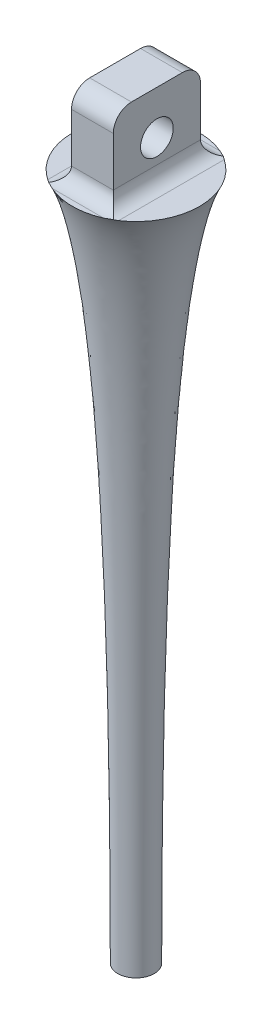
ISO-10303-21;
HEADER;
FILE_DESCRIPTION(('STEP AP214'),'2;1');
FILE_NAME('part.step','',(''),(''),'','','');
FILE_SCHEMA(('AUTOMOTIVE_DESIGN { 1 0 10303 214 1 1 1 1 }'));
ENDSEC;
DATA;
#1=APPLICATION_CONTEXT('core data for automotive mechanical design processes');
#2=APPLICATION_PROTOCOL_DEFINITION('international standard','automotive_design',2000,#1);
#3=PRODUCT_CONTEXT('',#1,'mechanical');
#4=PRODUCT('Part','Part','',(#3));
#5=PRODUCT_RELATED_PRODUCT_CATEGORY('part','',(#4));
#6=PRODUCT_DEFINITION_FORMATION('','',#4);
#7=PRODUCT_DEFINITION_CONTEXT('part definition',#1,'design');
#8=PRODUCT_DEFINITION('design','',#6,#7);
#9=PRODUCT_DEFINITION_SHAPE('','',#8);
#10=(LENGTH_UNIT() NAMED_UNIT(*) SI_UNIT(.MILLI.,.METRE.));
#11=(NAMED_UNIT(*) PLANE_ANGLE_UNIT() SI_UNIT($,.RADIAN.));
#12=(NAMED_UNIT(*) SI_UNIT($,.STERADIAN.) SOLID_ANGLE_UNIT());
#13=UNCERTAINTY_MEASURE_WITH_UNIT(LENGTH_MEASURE(1.E-05),#10,'distance_accuracy_value','');
#14=(GEOMETRIC_REPRESENTATION_CONTEXT(3) GLOBAL_UNCERTAINTY_ASSIGNED_CONTEXT((#13)) GLOBAL_UNIT_ASSIGNED_CONTEXT((#10,
#11,#12)) REPRESENTATION_CONTEXT('',''));
#15=CARTESIAN_POINT('',(0.,0.,0.));
#16=DIRECTION('',(0.,0.,1.));
#17=DIRECTION('',(1.,0.,0.));
#18=AXIS2_PLACEMENT_3D('',#15,#16,#17);
#19=CARTESIAN_POINT('',(0.,0.,0.));
#20=DIRECTION('',(0.,-1.,0.));
#21=DIRECTION('',(1.,0.,0.));
#22=AXIS2_PLACEMENT_3D('',#19,#20,#21);
#23=PLANE('',#22);
#24=CARTESIAN_POINT('',(0.,0.,0.));
#25=DIRECTION('',(0.,1.,0.));
#26=DIRECTION('',(-1.,0.,0.));
#27=AXIS2_PLACEMENT_3D('',#24,#25,#26);
#28=CIRCLE('',#27,3.5);
#29=CARTESIAN_POINT('',(-1.95,0.,-2.90645832586672));
#30=VERTEX_POINT('',#29);
#31=CARTESIAN_POINT('',(-1.95,0.,2.90645832586672));
#32=VERTEX_POINT('',#31);
#33=EDGE_CURVE('E167',#30,#32,#28,.T.);
#34=ORIENTED_EDGE('',*,*,#33,.T.);
#35=DIRECTION('',(0.,0.,1.));
#36=VECTOR('',#35,1.);
#37=CARTESIAN_POINT('',(-1.95,0.,-2.4));
#38=LINE('',#37,#36);
#39=EDGE_CURVE('E173',#32,#30,#38,.F.);
#40=ORIENTED_EDGE('',*,*,#39,.T.);
#41=EDGE_LOOP('',(#34,#40));
#42=FACE_BOUND('',#41,.T.);
#43=ADVANCED_FACE('F32',(#42),#23,.F.);
#44=CARTESIAN_POINT('',(1.41774468787578,0.,-3.2));
#45=VERTEX_POINT('',#44);
#46=CARTESIAN_POINT('',(-1.41774468787578,0.,-3.2));
#47=VERTEX_POINT('',#46);
#48=EDGE_CURVE('E264',#45,#47,#28,.T.);
#49=ORIENTED_EDGE('',*,*,#48,.T.);
#50=DIRECTION('',(-1.,0.,0.));
#51=VECTOR('',#50,1.);
#52=CARTESIAN_POINT('',(1.15,0.,-3.2));
#53=LINE('',#52,#51);
#54=EDGE_CURVE('E171',#47,#45,#53,.F.);
#55=ORIENTED_EDGE('',*,*,#54,.T.);
#56=EDGE_LOOP('',(#49,#55));
#57=FACE_BOUND('',#56,.T.);
#58=ADVANCED_FACE('F243',(#57),#23,.F.);
#59=CARTESIAN_POINT('',(-1.41774468787578,0.,3.2));
#60=VERTEX_POINT('',#59);
#61=CARTESIAN_POINT('',(1.41774468787578,0.,3.2));
#62=VERTEX_POINT('',#61);
#63=EDGE_CURVE('E160',#60,#62,#28,.T.);
#64=ORIENTED_EDGE('',*,*,#63,.T.);
#65=DIRECTION('',(1.,0.,0.));
#66=VECTOR('',#65,1.);
#67=CARTESIAN_POINT('',(-1.15,0.,3.2));
#68=LINE('',#67,#66);
#69=EDGE_CURVE('E162',#62,#60,#68,.F.);
#70=ORIENTED_EDGE('',*,*,#69,.T.);
#71=EDGE_LOOP('',(#64,#70));
#72=FACE_BOUND('',#71,.T.);
#73=ADVANCED_FACE('F248',(#72),#23,.F.);
#74=CARTESIAN_POINT('',(1.95,0.,2.90645832586672));
#75=VERTEX_POINT('',#74);
#76=CARTESIAN_POINT('',(1.95,0.,-2.90645832586672));
#77=VERTEX_POINT('',#76);
#78=EDGE_CURVE('E165',#75,#77,#28,.T.);
#79=ORIENTED_EDGE('',*,*,#78,.T.);
#80=DIRECTION('',(0.,0.,-1.));
#81=VECTOR('',#80,1.);
#82=CARTESIAN_POINT('',(1.95,0.,2.4));
#83=LINE('',#82,#81);
#84=EDGE_CURVE('E159',#77,#75,#83,.F.);
#85=ORIENTED_EDGE('',*,*,#84,.T.);
#86=EDGE_LOOP('',(#79,#85));
#87=FACE_BOUND('',#86,.T.);
#88=ADVANCED_FACE('F199',(#87),#23,.F.);
#89=CARTESIAN_POINT('',(1.,-37.8205680679207,0.));
#90=CARTESIAN_POINT('',(0.999999999999997,-11.1835944695086,0.));
#91=CARTESIAN_POINT('',(2.18653421701543,-2.52553796459548,0.));
#92=CARTESIAN_POINT('',(3.5,0.,0.));
#93=CARTESIAN_POINT('',(3.51313465782985,0.0252553796459548,0.));
#94=CARTESIAN_POINT('',(3.52626931565969,0.0505107592919096,0.));
#95=CARTESIAN_POINT('',(3.53940397348954,0.0757661389378643,0.));
#96=B_SPLINE_CURVE_WITH_KNOTS('',3,(#89,#90,#91,#92,#93,#94,#95),.UNSPECIFIED.,.F.,.F.,(4,3,4),
(0.,1.,1.01),.UNSPECIFIED.);
#97=CARTESIAN_POINT('',(0.,0.,0.));
#98=DIRECTION('',(0.,1.,0.));
#99=AXIS1_PLACEMENT('',#97,#98);
#100=SURFACE_OF_REVOLUTION('',#96,#99);
#101=ORIENTED_EDGE('',*,*,#63,.F.);
#102=CARTESIAN_POINT('',(-1.41774468787578,0.,3.2));
#103=CARTESIAN_POINT('',(-1.43804222254705,-3.94687160879733E-08,3.19100735660219));
#104=CARTESIAN_POINT('',(-1.45828628533577,0.000151630970978614,3.18189346900746));
#105=CARTESIAN_POINT('',(-1.49865012133321,0.000782335440212966,3.16344557331929));
#106=CARTESIAN_POINT('',(-1.51876997722664,0.00126112087444249,3.15411173757547));
#107=CARTESIAN_POINT('',(-1.55889077175201,0.00256966151873528,3.13523642657953));
#108=CARTESIAN_POINT('',(-1.57889175513437,0.00339927488720019,3.12569503671984));
#109=CARTESIAN_POINT('',(-1.61878110432213,0.00543334867689876,3.10641696434359));
#110=CARTESIAN_POINT('',(-1.63866946644596,0.00663782128103746,3.09668027548944));
#111=CARTESIAN_POINT('',(-1.67833737442683,0.00944587178265502,3.07702537496586));
#112=CARTESIAN_POINT('',(-1.69811687710415,0.0110495978125892,3.06710709719089));
#113=CARTESIAN_POINT('',(-1.73757190159674,0.0146809805103041,3.04710314087347));
#114=CARTESIAN_POINT('',(-1.75724732752526,0.0167089754303448,3.03701733470986));
#115=CARTESIAN_POINT('',(-1.77686102609484,0.0189603750672665,3.02686102609484));
#116=B_SPLINE_CURVE_WITH_KNOTS('',3,(#102,#103,#104,#105,#106,#107,#108,#109,#110,#111,#112,
#113,#114,#115),.UNSPECIFIED.,.F.,.F.,(4,2,2,2,2,2,4),(0.,0.0666006063665261,0.133150654949928,
0.199673822680888,0.26619915263704,0.332749201943982,0.399352512475468),.UNSPECIFIED.);
#117=CARTESIAN_POINT('',(-1.77686102609486,0.0189603750672687,3.02686102609485));
#118=VERTEX_POINT('',#117);
#119=EDGE_CURVE('E215',#60,#118,#116,.T.);
#120=ORIENTED_EDGE('',*,*,#119,.T.);
#121=CARTESIAN_POINT('',(-1.77686102609486,0.0189603750672687,3.02686102609485));
#122=CARTESIAN_POINT('',(-1.80515302163258,0.012673748317467,3.00647451339946));
#123=CARTESIAN_POINT('',(-1.83372726722687,0.00795040368696053,2.98624769869943));
#124=CARTESIAN_POINT('',(-1.89144025852858,0.00163027866453777,2.94611346529005));
#125=CARTESIAN_POINT('',(-1.92057900423601,3.34982726215113E-05,2.92620604658071));
#126=CARTESIAN_POINT('',(-1.95,0.,2.90645832586672));
#127=B_SPLINE_CURVE_WITH_KNOTS('',3,(#121,#122,#123,#124,#125,#126),.UNSPECIFIED.,.F.,.F.,(4,2,
4),(0.,0.105977798421264,0.211955596842529),.UNSPECIFIED.);
#128=EDGE_CURVE('E143',#118,#32,#127,.T.);
#129=ORIENTED_EDGE('',*,*,#128,.T.);
#130=ORIENTED_EDGE('',*,*,#33,.F.);
#131=CARTESIAN_POINT('',(-1.95,0.,-2.90645832586672));
#132=CARTESIAN_POINT('',(-1.92057900423601,3.34982726221557E-05,-2.92620604658072));
#133=CARTESIAN_POINT('',(-1.89144025852858,0.00163027866453856,-2.94611346529005));
#134=CARTESIAN_POINT('',(-1.83372726722686,0.0079504036869606,-2.98624769869943));
#135=CARTESIAN_POINT('',(-1.80515302163256,0.0126737483174662,-3.00647451339946));
#136=CARTESIAN_POINT('',(-1.77686102609484,0.0189603750672665,-3.02686102609484));
#137=B_SPLINE_CURVE_WITH_KNOTS('',3,(#131,#132,#133,#134,#135,#136),.UNSPECIFIED.,.F.,.F.,(4,2,
4),(0.,0.105977798421269,0.211955596842538),.UNSPECIFIED.);
#138=CARTESIAN_POINT('',(-1.77686102609484,0.0189603750672665,-3.02686102609484));
#139=VERTEX_POINT('',#138);
#140=EDGE_CURVE('E185',#30,#139,#137,.T.);
#141=ORIENTED_EDGE('',*,*,#140,.T.);
#142=CARTESIAN_POINT('',(-1.77686102609486,0.0189603750672687,-3.02686102609485));
#143=CARTESIAN_POINT('',(-1.75724732752527,0.0167089754303463,-3.03701733470987));
#144=CARTESIAN_POINT('',(-1.73757190159675,0.0146809805103052,-3.04710314087347));
#145=CARTESIAN_POINT('',(-1.69811687710416,0.0110495978125898,-3.06710709719088));
#146=CARTESIAN_POINT('',(-1.67833737442684,0.00944587178265557,-3.07702537496586));
#147=CARTESIAN_POINT('',(-1.63866946644596,0.00663782128103781,-3.09668027548943));
#148=CARTESIAN_POINT('',(-1.61878110432214,0.00543334867689897,-3.10641696434358));
#149=CARTESIAN_POINT('',(-1.57889175513437,0.00339927488720036,-3.12569503671984));
#150=CARTESIAN_POINT('',(-1.55889077175201,0.00256966151873555,-3.13523642657953));
#151=CARTESIAN_POINT('',(-1.51876997722664,0.00126112087444272,-3.15411173757547));
#152=CARTESIAN_POINT('',(-1.49865012133321,0.000782335440213072,-3.16344557331929));
#153=CARTESIAN_POINT('',(-1.45828628533577,0.000151630970978546,-3.18189346900746));
#154=CARTESIAN_POINT('',(-1.43804222254705,-3.94687162087663E-08,-3.19100735660219));
#155=CARTESIAN_POINT('',(-1.41774468787578,0.,-3.2));
#156=B_SPLINE_CURVE_WITH_KNOTS('',3,(#142,#143,#144,#145,#146,#147,#148,#149,#150,#151,#152,
#153,#154,#155),.UNSPECIFIED.,.F.,.F.,(4,2,2,2,2,2,4),(0.,0.0666033105314882,0.133153359838431,
0.199678689794586,0.266201857525548,0.332751906108952,0.39935251247548),.UNSPECIFIED.);
#157=EDGE_CURVE('E318',#139,#47,#156,.T.);
#158=ORIENTED_EDGE('',*,*,#157,.T.);
#159=ORIENTED_EDGE('',*,*,#48,.F.);
#160=CARTESIAN_POINT('',(1.41774468787578,0.,-3.2));
#161=CARTESIAN_POINT('',(1.43804222254705,-3.94687162946738E-08,-3.19100735660219));
#162=CARTESIAN_POINT('',(1.45828628533577,0.000151630970978402,-3.18189346900746));
#163=CARTESIAN_POINT('',(1.49865012133321,0.000782335440212743,-3.16344557331929));
#164=CARTESIAN_POINT('',(1.51876997722664,0.00126112087444226,-3.15411173757548));
#165=CARTESIAN_POINT('',(1.55889077175201,0.00256966151873504,-3.13523642657953));
#166=CARTESIAN_POINT('',(1.57889175513437,0.00339927488719994,-3.12569503671984));
#167=CARTESIAN_POINT('',(1.61878110432213,0.00543334867689851,-3.10641696434359));
#168=CARTESIAN_POINT('',(1.63866946644596,0.00663782128103722,-3.09668027548944));
#169=CARTESIAN_POINT('',(1.67833737442683,0.00944587178265472,-3.07702537496586));
#170=CARTESIAN_POINT('',(1.69811687710415,0.0110495978125888,-3.06710709719089));
#171=CARTESIAN_POINT('',(1.73757190159674,0.0146809805103037,-3.04710314087347));
#172=CARTESIAN_POINT('',(1.75724732752526,0.0167089754303444,-3.03701733470986));
#173=CARTESIAN_POINT('',(1.77686102609484,0.0189603750672662,-3.02686102609484));
#174=B_SPLINE_CURVE_WITH_KNOTS('',3,(#160,#161,#162,#163,#164,#165,#166,#167,#168,#169,#170,
#171,#172,#173),.UNSPECIFIED.,.F.,.F.,(4,2,2,2,2,2,4),(0.,0.0666006063665263,0.133150654949928,
0.199673822680888,0.26619915263704,0.332749201943982,0.399352512475468),.UNSPECIFIED.);
#175=CARTESIAN_POINT('',(1.77686102609484,0.0189603750672662,-3.02686102609484));
#176=VERTEX_POINT('',#175);
#177=EDGE_CURVE('E319',#45,#176,#174,.T.);
#178=ORIENTED_EDGE('',*,*,#177,.T.);
#179=CARTESIAN_POINT('',(1.77686102609486,0.0189603750672684,-3.02686102609485));
#180=CARTESIAN_POINT('',(1.80515302163258,0.012673748317467,-3.00647451339946));
#181=CARTESIAN_POINT('',(1.83372726722687,0.00795040368696055,-2.98624769869943));
#182=CARTESIAN_POINT('',(1.89144025852858,0.00163027866453779,-2.94611346529005));
#183=CARTESIAN_POINT('',(1.92057900423601,3.34982726214353E-05,-2.92620604658071));
#184=CARTESIAN_POINT('',(1.95,0.,-2.90645832586672));
#185=B_SPLINE_CURVE_WITH_KNOTS('',3,(#179,#180,#181,#182,#183,#184),.UNSPECIFIED.,.F.,.F.,(4,2,
4),(0.,0.105977798421265,0.21195559684253),.UNSPECIFIED.);
#186=EDGE_CURVE('E220',#176,#77,#185,.T.);
#187=ORIENTED_EDGE('',*,*,#186,.T.);
#188=ORIENTED_EDGE('',*,*,#78,.F.);
#189=CARTESIAN_POINT('',(1.95,0.,2.90645832586672));
#190=CARTESIAN_POINT('',(1.92057900423601,3.34982726220471E-05,2.92620604658072));
#191=CARTESIAN_POINT('',(1.89144025852858,0.00163027866453853,2.94611346529006));
#192=CARTESIAN_POINT('',(1.83372726722686,0.00795040368696057,2.98624769869943));
#193=CARTESIAN_POINT('',(1.80515302163256,0.0126737483174661,3.00647451339946));
#194=CARTESIAN_POINT('',(1.77686102609484,0.0189603750672662,3.02686102609484));
#195=B_SPLINE_CURVE_WITH_KNOTS('',3,(#189,#190,#191,#192,#193,#194),.UNSPECIFIED.,.F.,.F.,(4,2,
4),(0.,0.105977798421269,0.211955596842538),.UNSPECIFIED.);
#196=CARTESIAN_POINT('',(1.77686102609486,0.0189603750672685,3.02686102609485));
#197=VERTEX_POINT('',#196);
#198=EDGE_CURVE('E225',#75,#197,#195,.T.);
#199=ORIENTED_EDGE('',*,*,#198,.T.);
#200=CARTESIAN_POINT('',(1.77686102609486,0.0189603750672685,3.02686102609485));
#201=CARTESIAN_POINT('',(1.75724732752527,0.016708975430346,3.03701733470987));
#202=CARTESIAN_POINT('',(1.73757190159675,0.014680980510305,3.04710314087347));
#203=CARTESIAN_POINT('',(1.69811687710416,0.0110495978125896,3.06710709719088));
#204=CARTESIAN_POINT('',(1.67833737442684,0.00944587178265541,3.07702537496586));
#205=CARTESIAN_POINT('',(1.63866946644596,0.00663782128103764,3.09668027548943));
#206=CARTESIAN_POINT('',(1.61878110432214,0.00543334867689875,3.10641696434358));
#207=CARTESIAN_POINT('',(1.57889175513437,0.00339927488720011,3.12569503671984));
#208=CARTESIAN_POINT('',(1.55889077175201,0.00256966151873531,3.13523642657953));
#209=CARTESIAN_POINT('',(1.51876997722664,0.0012611208744425,3.15411173757547));
#210=CARTESIAN_POINT('',(1.49865012133321,0.000782335440212863,3.16344557331929));
#211=CARTESIAN_POINT('',(1.45828628533577,0.000151630970978348,3.18189346900746));
#212=CARTESIAN_POINT('',(1.43804222254705,-3.94687164056073E-08,3.19100735660219));
#213=CARTESIAN_POINT('',(1.41774468787578,0.,3.2));
#214=B_SPLINE_CURVE_WITH_KNOTS('',3,(#200,#201,#202,#203,#204,#205,#206,#207,#208,#209,#210,
#211,#212,#213),.UNSPECIFIED.,.F.,.F.,(4,2,2,2,2,2,4),(0.,0.066603310531488,0.133153359838432,
0.199678689794586,0.266201857525548,0.332751906108953,0.399352512475481),.UNSPECIFIED.);
#215=EDGE_CURVE('E209',#197,#62,#214,.T.);
#216=ORIENTED_EDGE('',*,*,#215,.T.);
#217=EDGE_LOOP('',(#101,#120,#129,#130,#141,#158,#159,#178,#187,#188,#199,#216));
#218=FACE_BOUND('',#217,.T.);
#219=CARTESIAN_POINT('',(0.,-37.8205680679207,0.));
#220=DIRECTION('',(0.,1.,0.));
#221=DIRECTION('',(-1.,0.,0.));
#222=AXIS2_PLACEMENT_3D('',#219,#220,#221);
#223=CIRCLE('',#222,1.00000000000001);
#224=CARTESIAN_POINT('',(-1.00000000000001,-37.8205680679207,0.));
#225=VERTEX_POINT('',#224);
#226=EDGE_CURVE('E299',#225,#225,#223,.T.);
#227=ORIENTED_EDGE('',*,*,#226,.T.);
#228=EDGE_LOOP('',(#227));
#229=FACE_BOUND('',#228,.T.);
#230=ADVANCED_FACE('F190',(#218,#229),#100,.T.);
#231=CARTESIAN_POINT('',(0.,-37.8205680679207,0.));
#232=DIRECTION('',(0.,1.,0.));
#233=DIRECTION('',(-1.,0.,0.));
#234=AXIS2_PLACEMENT_3D('',#231,#232,#233);
#235=PLANE('',#234);
#236=ORIENTED_EDGE('',*,*,#226,.F.);
#237=EDGE_LOOP('',(#236));
#238=FACE_BOUND('',#237,.T.);
#239=ADVANCED_FACE('F257',(#238),#235,.F.);
#240=CARTESIAN_POINT('',(1.15,4.5,2.4));
#241=DIRECTION('',(-1.,0.,0.));
#242=DIRECTION('',(0.,0.,1.));
#243=AXIS2_PLACEMENT_3D('',#240,#241,#242);
#244=PLANE('',#243);
#245=CARTESIAN_POINT('',(1.15,2.1,0.));
#246=DIRECTION('',(-1.,0.,0.));
#247=DIRECTION('',(0.,0.,1.));
#248=AXIS2_PLACEMENT_3D('',#245,#246,#247);
#249=CIRCLE('',#248,0.9);
#250=CARTESIAN_POINT('',(1.15,2.1,0.9));
#251=VERTEX_POINT('',#250);
#252=EDGE_CURVE('E293',#251,#251,#249,.F.);
#253=ORIENTED_EDGE('',*,*,#252,.F.);
#254=EDGE_LOOP('',(#253));
#255=FACE_BOUND('',#254,.T.);
#256=DIRECTION('',(0.,-1.,0.));
#257=VECTOR('',#256,1.);
#258=CARTESIAN_POINT('',(1.15,4.5,-2.4));
#259=LINE('',#258,#257);
#260=CARTESIAN_POINT('',(1.15,3.5,-2.4));
#261=VERTEX_POINT('',#260);
#262=CARTESIAN_POINT('',(1.15,0.8,-2.4));
#263=VERTEX_POINT('',#262);
#264=EDGE_CURVE('E289',#261,#263,#259,.T.);
#265=ORIENTED_EDGE('',*,*,#264,.F.);
#266=CARTESIAN_POINT('',(1.15,3.5,-1.4));
#267=DIRECTION('',(-1.,0.,0.));
#268=DIRECTION('',(0.,0.,1.));
#269=AXIS2_PLACEMENT_3D('',#266,#267,#268);
#270=CIRCLE('',#269,1.);
#271=CARTESIAN_POINT('',(1.15,4.5,-1.4));
#272=VERTEX_POINT('',#271);
#273=EDGE_CURVE('E40',#261,#272,#270,.F.);
#274=ORIENTED_EDGE('',*,*,#273,.T.);
#275=DIRECTION('',(0.,0.,-1.));
#276=VECTOR('',#275,1.);
#277=CARTESIAN_POINT('',(1.15,4.5,2.4));
#278=LINE('',#277,#276);
#279=CARTESIAN_POINT('',(1.15,4.5,1.4));
#280=VERTEX_POINT('',#279);
#281=EDGE_CURVE('E288',#280,#272,#278,.T.);
#282=ORIENTED_EDGE('',*,*,#281,.F.);
#283=CARTESIAN_POINT('',(1.15,3.5,1.4));
#284=DIRECTION('',(-1.,0.,0.));
#285=DIRECTION('',(0.,0.,1.));
#286=AXIS2_PLACEMENT_3D('',#283,#284,#285);
#287=CIRCLE('',#286,1.);
#288=CARTESIAN_POINT('',(1.15,3.5,2.4));
#289=VERTEX_POINT('',#288);
#290=EDGE_CURVE('E47',#280,#289,#287,.F.);
#291=ORIENTED_EDGE('',*,*,#290,.T.);
#292=DIRECTION('',(0.,-1.,0.));
#293=VECTOR('',#292,1.);
#294=CARTESIAN_POINT('',(1.15,4.5,2.4));
#295=LINE('',#294,#293);
#296=CARTESIAN_POINT('',(1.15,0.8,2.4));
#297=VERTEX_POINT('',#296);
#298=EDGE_CURVE('E132',#289,#297,#295,.T.);
#299=ORIENTED_EDGE('',*,*,#298,.T.);
#300=DIRECTION('',(0.,0.,-1.));
#301=VECTOR('',#300,1.);
#302=CARTESIAN_POINT('',(1.15,0.8,-2.4));
#303=LINE('',#302,#301);
#304=EDGE_CURVE('E153',#297,#263,#303,.T.);
#305=ORIENTED_EDGE('',*,*,#304,.T.);
#306=EDGE_LOOP('',(#265,#274,#282,#291,#299,#305));
#307=FACE_BOUND('',#306,.T.);
#308=ADVANCED_FACE('F287',(#255,#307),#244,.F.);
#309=CARTESIAN_POINT('',(-1.15,4.5,-2.4));
#310=DIRECTION('',(0.,0.,1.));
#311=DIRECTION('',(1.,0.,0.));
#312=AXIS2_PLACEMENT_3D('',#309,#310,#311);
#313=PLANE('',#312);
#314=DIRECTION('',(0.,-1.,0.));
#315=VECTOR('',#314,1.);
#316=CARTESIAN_POINT('',(-1.15,4.5,-2.4));
#317=LINE('',#316,#315);
#318=CARTESIAN_POINT('',(-1.15,3.5,-2.4));
#319=VERTEX_POINT('',#318);
#320=CARTESIAN_POINT('',(-1.15,0.8,-2.4));
#321=VERTEX_POINT('',#320);
#322=EDGE_CURVE('E131',#319,#321,#317,.T.);
#323=ORIENTED_EDGE('',*,*,#322,.F.);
#324=DIRECTION('',(-1.,0.,0.));
#325=VECTOR('',#324,1.);
#326=CARTESIAN_POINT('',(-1.15,3.5,-2.4));
#327=LINE('',#326,#325);
#328=EDGE_CURVE('E55',#319,#261,#327,.F.);
#329=ORIENTED_EDGE('',*,*,#328,.T.);
#330=ORIENTED_EDGE('',*,*,#264,.T.);
#331=DIRECTION('',(-1.,0.,0.));
#332=VECTOR('',#331,1.);
#333=CARTESIAN_POINT('',(-1.15,0.8,-2.4));
#334=LINE('',#333,#332);
#335=EDGE_CURVE('E154',#263,#321,#334,.T.);
#336=ORIENTED_EDGE('',*,*,#335,.T.);
#337=EDGE_LOOP('',(#323,#329,#330,#336));
#338=FACE_BOUND('',#337,.T.);
#339=ADVANCED_FACE('F295',(#338),#313,.F.);
#340=CARTESIAN_POINT('',(-1.15,4.5,2.4));
#341=DIRECTION('',(1.,0.,0.));
#342=DIRECTION('',(0.,0.,-1.));
#343=AXIS2_PLACEMENT_3D('',#340,#341,#342);
#344=PLANE('',#343);
#345=CARTESIAN_POINT('',(-1.15,2.1,0.));
#346=DIRECTION('',(-1.,0.,0.));
#347=DIRECTION('',(0.,0.,1.));
#348=AXIS2_PLACEMENT_3D('',#345,#346,#347);
#349=CIRCLE('',#348,0.9);
#350=CARTESIAN_POINT('',(-1.15,2.1,0.9));
#351=VERTEX_POINT('',#350);
#352=EDGE_CURVE('E328',#351,#351,#349,.T.);
#353=ORIENTED_EDGE('',*,*,#352,.F.);
#354=EDGE_LOOP('',(#353));
#355=FACE_BOUND('',#354,.T.);
#356=DIRECTION('',(0.,0.,1.));
#357=VECTOR('',#356,1.);
#358=CARTESIAN_POINT('',(-1.15,4.5,2.4));
#359=LINE('',#358,#357);
#360=CARTESIAN_POINT('',(-1.15,4.5,-1.4));
#361=VERTEX_POINT('',#360);
#362=CARTESIAN_POINT('',(-1.15,4.5,1.4));
#363=VERTEX_POINT('',#362);
#364=EDGE_CURVE('E292',#361,#363,#359,.T.);
#365=ORIENTED_EDGE('',*,*,#364,.F.);
#366=CARTESIAN_POINT('',(-1.15,3.5,-1.4));
#367=DIRECTION('',(1.,0.,0.));
#368=DIRECTION('',(0.,0.,-1.));
#369=AXIS2_PLACEMENT_3D('',#366,#367,#368);
#370=CIRCLE('',#369,1.);
#371=EDGE_CURVE('E284',#361,#319,#370,.F.);
#372=ORIENTED_EDGE('',*,*,#371,.T.);
#373=ORIENTED_EDGE('',*,*,#322,.T.);
#374=DIRECTION('',(0.,0.,1.));
#375=VECTOR('',#374,1.);
#376=CARTESIAN_POINT('',(-1.15,0.8,2.4));
#377=LINE('',#376,#375);
#378=CARTESIAN_POINT('',(-1.15,0.8,2.4));
#379=VERTEX_POINT('',#378);
#380=EDGE_CURVE('E141',#321,#379,#377,.T.);
#381=ORIENTED_EDGE('',*,*,#380,.T.);
#382=DIRECTION('',(0.,-1.,0.));
#383=VECTOR('',#382,1.);
#384=CARTESIAN_POINT('',(-1.15,4.5,2.4));
#385=LINE('',#384,#383);
#386=CARTESIAN_POINT('',(-1.15,3.5,2.4));
#387=VERTEX_POINT('',#386);
#388=EDGE_CURVE('E121',#387,#379,#385,.T.);
#389=ORIENTED_EDGE('',*,*,#388,.F.);
#390=CARTESIAN_POINT('',(-1.15,3.5,1.4));
#391=DIRECTION('',(1.,0.,0.));
#392=DIRECTION('',(0.,0.,-1.));
#393=AXIS2_PLACEMENT_3D('',#390,#391,#392);
#394=CIRCLE('',#393,1.);
#395=EDGE_CURVE('E277',#387,#363,#394,.F.);
#396=ORIENTED_EDGE('',*,*,#395,.T.);
#397=EDGE_LOOP('',(#365,#372,#373,#381,#389,#396));
#398=FACE_BOUND('',#397,.T.);
#399=ADVANCED_FACE('F157',(#355,#398),#344,.F.);
#400=CARTESIAN_POINT('',(-1.15,4.5,2.4));
#401=DIRECTION('',(0.,0.,-1.));
#402=DIRECTION('',(-1.,0.,0.));
#403=AXIS2_PLACEMENT_3D('',#400,#401,#402);
#404=PLANE('',#403);
#405=ORIENTED_EDGE('',*,*,#298,.F.);
#406=DIRECTION('',(1.,0.,0.));
#407=VECTOR('',#406,1.);
#408=CARTESIAN_POINT('',(-1.15,3.5,2.4));
#409=LINE('',#408,#407);
#410=EDGE_CURVE('E11',#289,#387,#409,.F.);
#411=ORIENTED_EDGE('',*,*,#410,.T.);
#412=ORIENTED_EDGE('',*,*,#388,.T.);
#413=DIRECTION('',(1.,0.,0.));
#414=VECTOR('',#413,1.);
#415=CARTESIAN_POINT('',(1.15,0.8,2.4));
#416=LINE('',#415,#414);
#417=EDGE_CURVE('E125',#379,#297,#416,.T.);
#418=ORIENTED_EDGE('',*,*,#417,.T.);
#419=EDGE_LOOP('',(#405,#411,#412,#418));
#420=FACE_BOUND('',#419,.T.);
#421=ADVANCED_FACE('F123',(#420),#404,.F.);
#422=CARTESIAN_POINT('',(0.,4.5,0.));
#423=DIRECTION('',(0.,-1.,0.));
#424=DIRECTION('',(0.,0.,-1.));
#425=AXIS2_PLACEMENT_3D('',#422,#423,#424);
#426=PLANE('',#425);
#427=ORIENTED_EDGE('',*,*,#281,.T.);
#428=DIRECTION('',(-1.,0.,0.));
#429=VECTOR('',#428,1.);
#430=CARTESIAN_POINT('',(0.,4.5,-1.4));
#431=LINE('',#430,#429);
#432=EDGE_CURVE('E270',#272,#361,#431,.T.);
#433=ORIENTED_EDGE('',*,*,#432,.T.);
#434=ORIENTED_EDGE('',*,*,#364,.T.);
#435=DIRECTION('',(1.,0.,0.));
#436=VECTOR('',#435,1.);
#437=CARTESIAN_POINT('',(0.,4.5,1.4));
#438=LINE('',#437,#436);
#439=EDGE_CURVE('E268',#363,#280,#438,.T.);
#440=ORIENTED_EDGE('',*,*,#439,.T.);
#441=EDGE_LOOP('',(#427,#433,#434,#440));
#442=FACE_BOUND('',#441,.T.);
#443=ADVANCED_FACE('F291',(#442),#426,.F.);
#444=CARTESIAN_POINT('',(3.501,2.1,0.));
#445=DIRECTION('',(-1.,0.,0.));
#446=DIRECTION('',(0.,0.,1.));
#447=AXIS2_PLACEMENT_3D('',#444,#445,#446);
#448=CYLINDRICAL_SURFACE('',#447,0.9);
#449=ORIENTED_EDGE('',*,*,#352,.T.);
#450=EDGE_LOOP('',(#449));
#451=FACE_BOUND('',#450,.T.);
#452=ORIENTED_EDGE('',*,*,#252,.T.);
#453=EDGE_LOOP('',(#452));
#454=FACE_BOUND('',#453,.T.);
#455=ADVANCED_FACE('F232',(#451,#454),#448,.F.);
#456=CARTESIAN_POINT('',(1.95,0.8,2.4));
#457=DIRECTION('',(0.,0.,1.));
#458=DIRECTION('',(1.,0.,0.));
#459=AXIS2_PLACEMENT_3D('',#456,#457,#458);
#460=CYLINDRICAL_SURFACE('',#459,0.8);
#461=ORIENTED_EDGE('',*,*,#84,.F.);
#462=ORIENTED_EDGE('',*,*,#186,.F.);
#463=CARTESIAN_POINT('',(1.95,0.8,-3.2));
#464=DIRECTION('',(0.707106781186547,0.,0.707106781186547));
#465=DIRECTION('',(0.707106781186547,0.,-0.707106781186547));
#466=AXIS2_PLACEMENT_3D('',#463,#464,#465);
#467=ELLIPSE('',#466,1.13137084989848,0.8);
#468=EDGE_CURVE('E280',#263,#176,#467,.T.);
#469=ORIENTED_EDGE('',*,*,#468,.F.);
#470=ORIENTED_EDGE('',*,*,#304,.F.);
#471=CARTESIAN_POINT('',(1.95,0.8,3.2));
#472=DIRECTION('',(-0.707106781186547,0.,0.707106781186547));
#473=DIRECTION('',(-0.707106781186547,0.,-0.707106781186547));
#474=AXIS2_PLACEMENT_3D('',#471,#472,#473);
#475=ELLIPSE('',#474,1.13137084989848,0.8);
#476=EDGE_CURVE('E152',#197,#297,#475,.F.);
#477=ORIENTED_EDGE('',*,*,#476,.F.);
#478=ORIENTED_EDGE('',*,*,#198,.F.);
#479=EDGE_LOOP('',(#461,#462,#469,#470,#477,#478));
#480=FACE_BOUND('',#479,.T.);
#481=ADVANCED_FACE('F229',(#480),#460,.F.);
#482=CARTESIAN_POINT('',(-1.15,0.8,-3.2));
#483=DIRECTION('',(1.,0.,0.));
#484=DIRECTION('',(0.,1.,0.));
#485=AXIS2_PLACEMENT_3D('',#482,#483,#484);
#486=CYLINDRICAL_SURFACE('',#485,0.8);
#487=ORIENTED_EDGE('',*,*,#54,.F.);
#488=ORIENTED_EDGE('',*,*,#157,.F.);
#489=CARTESIAN_POINT('',(-1.95,0.8,-3.2));
#490=DIRECTION('',(0.707106781186547,0.,-0.707106781186547));
#491=DIRECTION('',(-0.707106781186547,0.,-0.707106781186547));
#492=AXIS2_PLACEMENT_3D('',#489,#490,#491);
#493=ELLIPSE('',#492,1.13137084989848,0.8);
#494=EDGE_CURVE('E146',#321,#139,#493,.T.);
#495=ORIENTED_EDGE('',*,*,#494,.F.);
#496=ORIENTED_EDGE('',*,*,#335,.F.);
#497=ORIENTED_EDGE('',*,*,#468,.T.);
#498=ORIENTED_EDGE('',*,*,#177,.F.);
#499=EDGE_LOOP('',(#487,#488,#495,#496,#497,#498));
#500=FACE_BOUND('',#499,.T.);
#501=ADVANCED_FACE('F204',(#500),#486,.F.);
#502=CARTESIAN_POINT('',(-1.15,0.8,3.2));
#503=DIRECTION('',(-1.,0.,0.));
#504=DIRECTION('',(0.,-1.,0.));
#505=AXIS2_PLACEMENT_3D('',#502,#503,#504);
#506=CYLINDRICAL_SURFACE('',#505,0.8);
#507=ORIENTED_EDGE('',*,*,#476,.T.);
#508=ORIENTED_EDGE('',*,*,#417,.F.);
#509=CARTESIAN_POINT('',(-1.95,0.8,3.2));
#510=DIRECTION('',(-0.707106781186547,0.,-0.707106781186547));
#511=DIRECTION('',(0.707106781186547,0.,-0.707106781186547));
#512=AXIS2_PLACEMENT_3D('',#509,#510,#511);
#513=ELLIPSE('',#512,1.13137084989848,0.8);
#514=EDGE_CURVE('E138',#118,#379,#513,.F.);
#515=ORIENTED_EDGE('',*,*,#514,.F.);
#516=ORIENTED_EDGE('',*,*,#119,.F.);
#517=ORIENTED_EDGE('',*,*,#69,.F.);
#518=ORIENTED_EDGE('',*,*,#215,.F.);
#519=EDGE_LOOP('',(#507,#508,#515,#516,#517,#518));
#520=FACE_BOUND('',#519,.T.);
#521=ADVANCED_FACE('F149',(#520),#506,.F.);
#522=CARTESIAN_POINT('',(-1.95,0.8,2.4));
#523=DIRECTION('',(0.,0.,-1.));
#524=DIRECTION('',(-1.,0.,0.));
#525=AXIS2_PLACEMENT_3D('',#522,#523,#524);
#526=CYLINDRICAL_SURFACE('',#525,0.8);
#527=ORIENTED_EDGE('',*,*,#140,.F.);
#528=ORIENTED_EDGE('',*,*,#39,.F.);
#529=ORIENTED_EDGE('',*,*,#128,.F.);
#530=ORIENTED_EDGE('',*,*,#514,.T.);
#531=ORIENTED_EDGE('',*,*,#380,.F.);
#532=ORIENTED_EDGE('',*,*,#494,.T.);
#533=EDGE_LOOP('',(#527,#528,#529,#530,#531,#532));
#534=FACE_BOUND('',#533,.T.);
#535=ADVANCED_FACE('F139',(#534),#526,.F.);
#536=CARTESIAN_POINT('',(0.,3.5,-1.4));
#537=DIRECTION('',(-1.,0.,0.));
#538=DIRECTION('',(0.,0.,1.));
#539=AXIS2_PLACEMENT_3D('',#536,#537,#538);
#540=CYLINDRICAL_SURFACE('',#539,1.);
#541=ORIENTED_EDGE('',*,*,#273,.F.);
#542=ORIENTED_EDGE('',*,*,#328,.F.);
#543=ORIENTED_EDGE('',*,*,#371,.F.);
#544=ORIENTED_EDGE('',*,*,#432,.F.);
#545=EDGE_LOOP('',(#541,#542,#543,#544));
#546=FACE_BOUND('',#545,.T.);
#547=ADVANCED_FACE('F198',(#546),#540,.T.);
#548=CARTESIAN_POINT('',(0.,3.5,1.4));
#549=DIRECTION('',(1.,0.,0.));
#550=DIRECTION('',(0.,0.,-1.));
#551=AXIS2_PLACEMENT_3D('',#548,#549,#550);
#552=CYLINDRICAL_SURFACE('',#551,1.);
#553=ORIENTED_EDGE('',*,*,#395,.F.);
#554=ORIENTED_EDGE('',*,*,#410,.F.);
#555=ORIENTED_EDGE('',*,*,#290,.F.);
#556=ORIENTED_EDGE('',*,*,#439,.F.);
#557=EDGE_LOOP('',(#553,#554,#555,#556));
#558=FACE_BOUND('',#557,.T.);
#559=ADVANCED_FACE('F34',(#558),#552,.T.);
#560=CLOSED_SHELL('',(#43,#58,#73,#88,#230,#239,#308,#339,#399,#421,#443,#455,#481,#501,#521,
#535,#547,#559));
#561=MANIFOLD_SOLID_BREP('B2',#560);
#562=ADVANCED_BREP_SHAPE_REPRESENTATION('',(#18,#561),#14);
#563=SHAPE_DEFINITION_REPRESENTATION(#9,#562);
ENDSEC;
END-ISO-10303-21;
